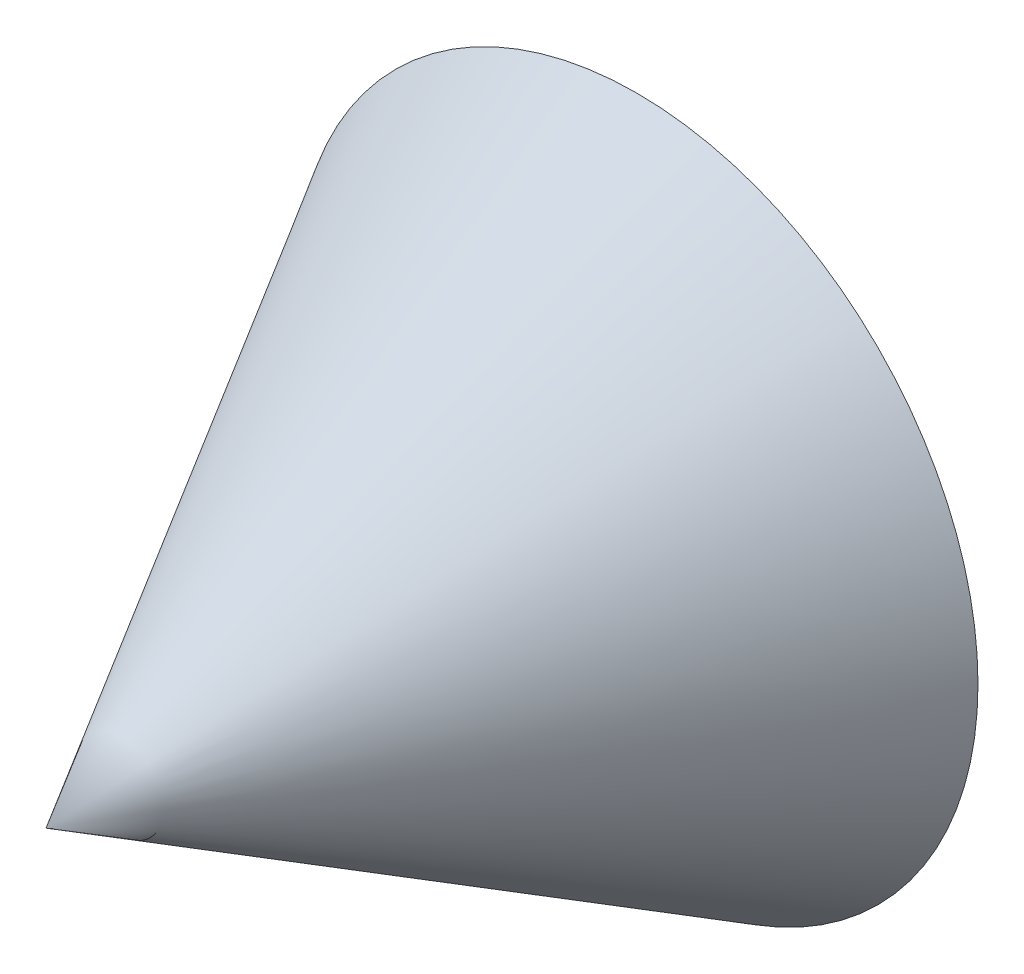
ISO-10303-21;
HEADER;
FILE_DESCRIPTION(('STEP AP214'),'2;1');
FILE_NAME('part.step','',(''),(''),'','','');
FILE_SCHEMA(('AUTOMOTIVE_DESIGN { 1 0 10303 214 1 1 1 1 }'));
ENDSEC;
DATA;
#1=APPLICATION_CONTEXT('core data for automotive mechanical design processes');
#2=APPLICATION_PROTOCOL_DEFINITION('international standard','automotive_design',2000,#1);
#3=PRODUCT_CONTEXT('',#1,'mechanical');
#4=PRODUCT('Part','Part','',(#3));
#5=PRODUCT_RELATED_PRODUCT_CATEGORY('part','',(#4));
#6=PRODUCT_DEFINITION_FORMATION('','',#4);
#7=PRODUCT_DEFINITION_CONTEXT('part definition',#1,'design');
#8=PRODUCT_DEFINITION('design','',#6,#7);
#9=PRODUCT_DEFINITION_SHAPE('','',#8);
#10=(LENGTH_UNIT() NAMED_UNIT(*) SI_UNIT(.MILLI.,.METRE.));
#11=(NAMED_UNIT(*) PLANE_ANGLE_UNIT() SI_UNIT($,.RADIAN.));
#12=(NAMED_UNIT(*) SI_UNIT($,.STERADIAN.) SOLID_ANGLE_UNIT());
#13=UNCERTAINTY_MEASURE_WITH_UNIT(LENGTH_MEASURE(1.E-05),#10,'distance_accuracy_value','');
#14=(GEOMETRIC_REPRESENTATION_CONTEXT(3) GLOBAL_UNCERTAINTY_ASSIGNED_CONTEXT((#13)) GLOBAL_UNIT_ASSIGNED_CONTEXT((#10,
#11,#12)) REPRESENTATION_CONTEXT('',''));
#15=CARTESIAN_POINT('',(0.,0.,0.));
#16=DIRECTION('',(0.,0.,1.));
#17=DIRECTION('',(1.,0.,0.));
#18=AXIS2_PLACEMENT_3D('',#15,#16,#17);
#19=CARTESIAN_POINT('',(0.,0.,0.));
#20=DIRECTION('',(0.,0.,-1.));
#21=DIRECTION('',(-1.,0.,0.));
#22=AXIS2_PLACEMENT_3D('',#19,#20,#21);
#23=CONICAL_SURFACE('',#22,0.,0.523598775598293);
#24=CARTESIAN_POINT('',(0.,0.,-200.));
#25=DIRECTION('',(0.,0.,1.));
#26=DIRECTION('',(1.,0.,0.));
#27=AXIS2_PLACEMENT_3D('',#24,#25,#26);
#28=CIRCLE('',#27,115.470053837924);
#29=CARTESIAN_POINT('',(115.470053837924,0.,-200.));
#30=VERTEX_POINT('',#29);
#31=EDGE_CURVE('E11',#30,#30,#28,.T.);
#32=ORIENTED_EDGE('',*,*,#31,.T.);
#33=EDGE_LOOP('',(#32));
#34=FACE_BOUND('',#33,.T.);
#35=CARTESIAN_POINT('',(0.,0.,0.));
#36=VERTEX_POINT('',#35);
#37=VERTEX_LOOP('',#36);
#38=FACE_BOUND('',#37,.T.);
#39=ADVANCED_FACE('F39',(#34,#38),#23,.T.);
#40=CARTESIAN_POINT('',(0.,0.,-200.));
#41=DIRECTION('',(0.,0.,-1.));
#42=DIRECTION('',(-1.,0.,0.));
#43=AXIS2_PLACEMENT_3D('',#40,#41,#42);
#44=PLANE('',#43);
#45=ORIENTED_EDGE('',*,*,#31,.F.);
#46=EDGE_LOOP('',(#45));
#47=FACE_BOUND('',#46,.T.);
#48=ADVANCED_FACE('F47',(#47),#44,.T.);
#49=CLOSED_SHELL('',(#39,#48));
#50=MANIFOLD_SOLID_BREP('B2',#49);
#51=ADVANCED_BREP_SHAPE_REPRESENTATION('',(#18,#50),#14);
#52=SHAPE_DEFINITION_REPRESENTATION(#9,#51);
ENDSEC;
END-ISO-10303-21;
